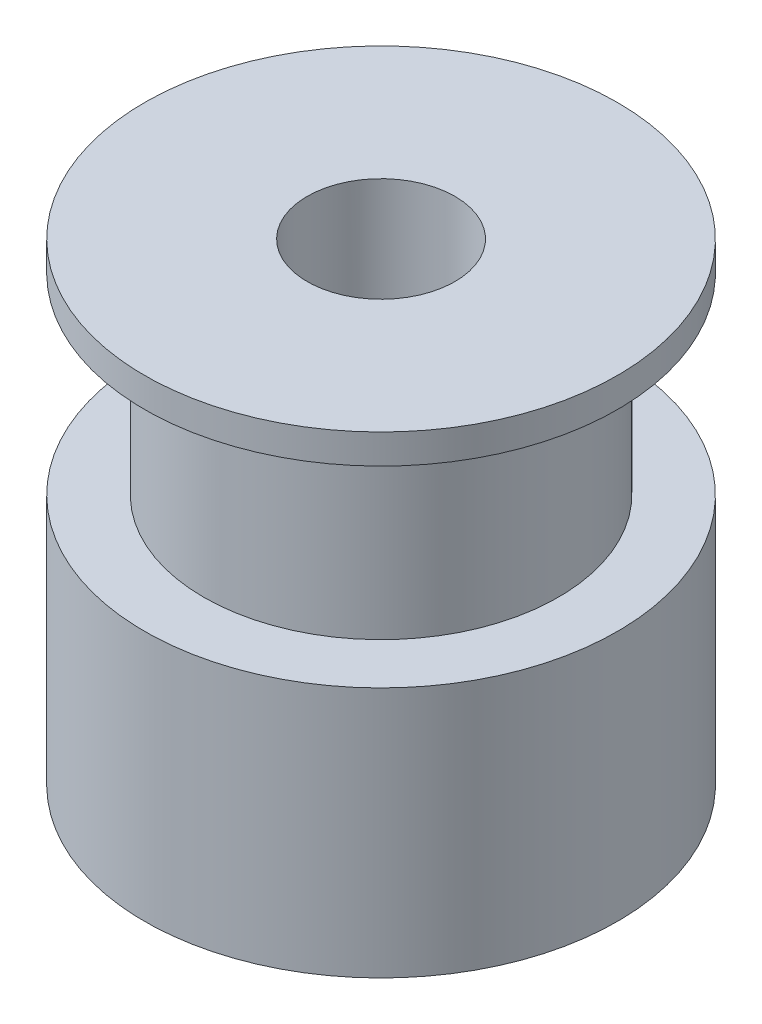
ISO-10303-21;
HEADER;
FILE_DESCRIPTION(('STEP AP214'),'2;1');
FILE_NAME('part.step','',(''),(''),'','','');
FILE_SCHEMA(('AUTOMOTIVE_DESIGN { 1 0 10303 214 1 1 1 1 }'));
ENDSEC;
DATA;
#1=APPLICATION_CONTEXT('core data for automotive mechanical design processes');
#2=APPLICATION_PROTOCOL_DEFINITION('international standard','automotive_design',2000,#1);
#3=PRODUCT_CONTEXT('',#1,'mechanical');
#4=PRODUCT('Part','Part','',(#3));
#5=PRODUCT_RELATED_PRODUCT_CATEGORY('part','',(#4));
#6=PRODUCT_DEFINITION_FORMATION('','',#4);
#7=PRODUCT_DEFINITION_CONTEXT('part definition',#1,'design');
#8=PRODUCT_DEFINITION('design','',#6,#7);
#9=PRODUCT_DEFINITION_SHAPE('','',#8);
#10=(LENGTH_UNIT() NAMED_UNIT(*) SI_UNIT(.MILLI.,.METRE.));
#11=(NAMED_UNIT(*) PLANE_ANGLE_UNIT() SI_UNIT($,.RADIAN.));
#12=(NAMED_UNIT(*) SI_UNIT($,.STERADIAN.) SOLID_ANGLE_UNIT());
#13=UNCERTAINTY_MEASURE_WITH_UNIT(LENGTH_MEASURE(1.E-05),#10,'distance_accuracy_value','');
#14=(GEOMETRIC_REPRESENTATION_CONTEXT(3) GLOBAL_UNCERTAINTY_ASSIGNED_CONTEXT((#13)) GLOBAL_UNIT_ASSIGNED_CONTEXT((#10,
#11,#12)) REPRESENTATION_CONTEXT('',''));
#15=CARTESIAN_POINT('',(0.,0.,0.));
#16=DIRECTION('',(0.,0.,1.));
#17=DIRECTION('',(1.,0.,0.));
#18=AXIS2_PLACEMENT_3D('',#15,#16,#17);
#19=CARTESIAN_POINT('',(0.,0.,0.));
#20=DIRECTION('',(0.,-1.,0.));
#21=DIRECTION('',(0.,0.,-1.));
#22=AXIS2_PLACEMENT_3D('',#19,#20,#21);
#23=CYLINDRICAL_SURFACE('',#22,6.);
#24=CARTESIAN_POINT('',(0.,8.5,0.));
#25=DIRECTION('',(0.,-1.,0.));
#26=DIRECTION('',(0.,0.,-1.));
#27=AXIS2_PLACEMENT_3D('',#24,#25,#26);
#28=CIRCLE('',#27,6.);
#29=CARTESIAN_POINT('',(0.,8.5,-6.));
#30=VERTEX_POINT('',#29);
#31=EDGE_CURVE('E86',#30,#30,#28,.T.);
#32=ORIENTED_EDGE('',*,*,#31,.F.);
#33=EDGE_LOOP('',(#32));
#34=FACE_BOUND('',#33,.T.);
#35=CARTESIAN_POINT('',(0.,15.,0.));
#36=DIRECTION('',(0.,-1.,0.));
#37=DIRECTION('',(0.,0.,-1.));
#38=AXIS2_PLACEMENT_3D('',#35,#36,#37);
#39=CIRCLE('',#38,6.);
#40=CARTESIAN_POINT('',(0.,15.,-6.));
#41=VERTEX_POINT('',#40);
#42=EDGE_CURVE('E54',#41,#41,#39,.T.);
#43=ORIENTED_EDGE('',*,*,#42,.T.);
#44=EDGE_LOOP('',(#43));
#45=FACE_BOUND('',#44,.T.);
#46=ADVANCED_FACE('F39',(#34,#45),#23,.T.);
#47=CARTESIAN_POINT('',(-8.,15.,0.));
#48=DIRECTION('',(0.,1.,0.));
#49=DIRECTION('',(0.,0.,1.));
#50=AXIS2_PLACEMENT_3D('',#47,#48,#49);
#51=PLANE('',#50);
#52=ORIENTED_EDGE('',*,*,#42,.F.);
#53=EDGE_LOOP('',(#52));
#54=FACE_BOUND('',#53,.T.);
#55=CARTESIAN_POINT('',(0.,15.,0.));
#56=DIRECTION('',(0.,-1.,0.));
#57=DIRECTION('',(0.,0.,-1.));
#58=AXIS2_PLACEMENT_3D('',#55,#56,#57);
#59=CIRCLE('',#58,8.);
#60=CARTESIAN_POINT('',(0.,15.,-8.));
#61=VERTEX_POINT('',#60);
#62=EDGE_CURVE('E58',#61,#61,#59,.T.);
#63=ORIENTED_EDGE('',*,*,#62,.T.);
#64=EDGE_LOOP('',(#63));
#65=FACE_BOUND('',#64,.T.);
#66=ADVANCED_FACE('F105',(#54,#65),#51,.F.);
#67=CARTESIAN_POINT('',(0.,0.,0.));
#68=DIRECTION('',(0.,-1.,0.));
#69=DIRECTION('',(0.,0.,-1.));
#70=AXIS2_PLACEMENT_3D('',#67,#68,#69);
#71=CYLINDRICAL_SURFACE('',#70,8.);
#72=ORIENTED_EDGE('',*,*,#62,.F.);
#73=EDGE_LOOP('',(#72));
#74=FACE_BOUND('',#73,.T.);
#75=CARTESIAN_POINT('',(0.,16.,0.));
#76=DIRECTION('',(0.,-1.,0.));
#77=DIRECTION('',(0.,0.,-1.));
#78=AXIS2_PLACEMENT_3D('',#75,#76,#77);
#79=CIRCLE('',#78,8.);
#80=CARTESIAN_POINT('',(0.,16.,-8.));
#81=VERTEX_POINT('',#80);
#82=EDGE_CURVE('E117',#81,#81,#79,.T.);
#83=ORIENTED_EDGE('',*,*,#82,.T.);
#84=EDGE_LOOP('',(#83));
#85=FACE_BOUND('',#84,.T.);
#86=ADVANCED_FACE('F102',(#74,#85),#71,.T.);
#87=CARTESIAN_POINT('',(-2.5,16.,0.));
#88=DIRECTION('',(0.,-1.,0.));
#89=DIRECTION('',(0.,0.,-1.));
#90=AXIS2_PLACEMENT_3D('',#87,#88,#89);
#91=PLANE('',#90);
#92=ORIENTED_EDGE('',*,*,#82,.F.);
#93=EDGE_LOOP('',(#92));
#94=FACE_BOUND('',#93,.T.);
#95=CARTESIAN_POINT('',(0.,16.,0.));
#96=DIRECTION('',(0.,-1.,0.));
#97=DIRECTION('',(0.,0.,-1.));
#98=AXIS2_PLACEMENT_3D('',#95,#96,#97);
#99=CIRCLE('',#98,2.5);
#100=CARTESIAN_POINT('',(0.,16.,-2.5));
#101=VERTEX_POINT('',#100);
#102=EDGE_CURVE('E119',#101,#101,#99,.T.);
#103=ORIENTED_EDGE('',*,*,#102,.T.);
#104=EDGE_LOOP('',(#103));
#105=FACE_BOUND('',#104,.T.);
#106=ADVANCED_FACE('F97',(#94,#105),#91,.F.);
#107=CARTESIAN_POINT('',(0.,0.,0.));
#108=DIRECTION('',(0.,-1.,0.));
#109=DIRECTION('',(0.,0.,-1.));
#110=AXIS2_PLACEMENT_3D('',#107,#108,#109);
#111=CYLINDRICAL_SURFACE('',#110,2.5);
#112=CARTESIAN_POINT('',(0.,5.75,-2.5));
#113=CARTESIAN_POINT('',(0.0767298334620158,5.74999590899012,-2.49999625789732));
#114=CARTESIAN_POINT('',(0.153582320644178,5.74407132907373,-2.4964290461501));
#115=CARTESIAN_POINT('',(0.304975509530679,5.72067568048467,-2.48249903608568));
#116=CARTESIAN_POINT('',(0.379510034596047,5.70317613814577,-2.47211948032719));
#117=CARTESIAN_POINT('',(0.523751827790837,5.65761363883314,-2.44561558054488));
#118=CARTESIAN_POINT('',(0.593481028226566,5.62960304183684,-2.42951973272944));
#119=CARTESIAN_POINT('',(0.727030318214658,5.56413966685897,-2.39295367626407));
#120=CARTESIAN_POINT('',(0.790851869416383,5.52668923303125,-2.37248455380255));
#121=CARTESIAN_POINT('',(0.916299278999315,5.44022517329141,-2.32705360719088));
#122=CARTESIAN_POINT('',(0.977384020081415,5.39054630464861,-2.30186792195985));
#123=CARTESIAN_POINT('',(1.09088270411891,5.28253279617173,-2.25030439279634));
#124=CARTESIAN_POINT('',(1.14328534948112,5.22418706281268,-2.22392505153571));
#125=CARTESIAN_POINT('',(1.24444996762974,5.09207648950327,-2.1691106699591));
#126=CARTESIAN_POINT('',(1.29197766378809,5.01729822901871,-2.14082017703649));
#127=CARTESIAN_POINT('',(1.37361437764896,4.85915342675688,-2.08938301412124));
#128=CARTESIAN_POINT('',(1.4077451733516,4.77580110375243,-2.06622802273938));
#129=CARTESIAN_POINT('',(1.45440601714221,4.62340354934676,-2.0335462966093));
#130=CARTESIAN_POINT('',(1.47016197246826,4.55576400138968,-2.02207883137591));
#131=CARTESIAN_POINT('',(1.49216172340475,4.41819628416964,-2.00590308295503));
#132=CARTESIAN_POINT('',(1.49841734556836,4.34827107124551,-2.00118639643759));
#133=CARTESIAN_POINT('',(1.50105508796009,4.20798850578266,-1.99920922463856));
#134=CARTESIAN_POINT('',(1.49741783408419,4.1376305749068,-2.00196337012718));
#135=CARTESIAN_POINT('',(1.48046060478828,3.99872122457241,-2.01453261443741));
#136=CARTESIAN_POINT('',(1.46713334620103,3.93017120415255,-2.02435302432226));
#137=CARTESIAN_POINT('',(1.43173921881792,3.79746975787189,-2.04953186944258));
#138=CARTESIAN_POINT('',(1.40978748666087,3.73327294607552,-2.06481711652537));
#139=CARTESIAN_POINT('',(1.35795061770837,3.60930500907188,-2.09927051350828));
#140=CARTESIAN_POINT('',(1.32806257259705,3.54953551657607,-2.11844008623465));
#141=CARTESIAN_POINT('',(1.25517983184583,3.4250159028772,-2.16255327268985));
#142=CARTESIAN_POINT('',(1.21080724397723,3.36122190704507,-2.18792043372992));
#143=CARTESIAN_POINT('',(1.11291092784003,3.24132351633298,-2.23930599764381));
#144=CARTESIAN_POINT('',(1.05937845100579,3.18522656602349,-2.26532500262149));
#145=CARTESIAN_POINT('',(0.935811834382966,3.07438701817824,-2.31935504958317));
#146=CARTESIAN_POINT('',(0.864517682704956,3.02092269398401,-2.34713836268532));
#147=CARTESIAN_POINT('',(0.712276050458999,2.92687795280209,-2.39772428433981));
#148=CARTESIAN_POINT('',(0.631333763943563,2.88629064621005,-2.42052955425515));
#149=CARTESIAN_POINT('',(0.467197585268205,2.8220678172041,-2.45730392066151));
#150=CARTESIAN_POINT('',(0.384467624173579,2.79752464428408,-2.47173957439704));
#151=CARTESIAN_POINT('',(0.215047895144639,2.76298880259462,-2.49218842813551));
#152=CARTESIAN_POINT('',(0.128363005661319,2.75297868224642,-2.49821172952738));
#153=CARTESIAN_POINT('',(-0.0337146143773963,2.74849215232169,-2.5009057037461));
#154=CARTESIAN_POINT('',(-0.109042473418718,2.75209114491483,-2.49873521714286));
#155=CARTESIAN_POINT('',(-0.25782940198606,2.77042585307192,-2.48778712087048));
#156=CARTESIAN_POINT('',(-0.331288509376105,2.78516134280581,-2.47900964518037));
#157=CARTESIAN_POINT('',(-0.472574932157613,2.82454343281246,-2.4559479244219));
#158=CARTESIAN_POINT('',(-0.540495750928483,2.84894034907347,-2.44180275662555));
#159=CARTESIAN_POINT('',(-0.671265749087262,2.90667737636527,-2.40913880862844));
#160=CARTESIAN_POINT('',(-0.734113924963908,2.94001925134667,-2.39061916586511));
#161=CARTESIAN_POINT('',(-0.860006262823863,3.0185569792087,-2.3484549623736));
#162=CARTESIAN_POINT('',(-0.922394150456837,3.06462382907839,-2.3244780273988));
#163=CARTESIAN_POINT('',(-1.03902603131014,3.16539139348862,-2.27474265574732));
#164=CARTESIAN_POINT('',(-1.09326040273738,3.22010215485253,-2.2489821658636));
#165=CARTESIAN_POINT('',(-1.19931996735579,3.34491039003715,-2.19445423909891));
#166=CARTESIAN_POINT('',(-1.24991019630915,3.4160838854655,-2.16573241746291));
#167=CARTESIAN_POINT('',(-1.33845238915668,3.5672160245682,-2.1121618206671));
#168=CARTESIAN_POINT('',(-1.37641766769781,3.64716529389278,-2.0873089799769));
#169=CARTESIAN_POINT('',(-1.43142578795776,3.79624302230669,-2.04984909240519));
#170=CARTESIAN_POINT('',(-1.4512162533619,3.86398031235859,-2.03575659328729));
#171=CARTESIAN_POINT('',(-1.48113663905972,4.0025320780801,-2.01409605743544));
#172=CARTESIAN_POINT('',(-1.49127995297631,4.07334214432783,-2.00651897642721));
#173=CARTESIAN_POINT('',(-1.50134130416631,4.21637694759703,-1.99900446616268));
#174=CARTESIAN_POINT('',(-1.50122089107869,4.28860599068704,-1.99909576445937));
#175=CARTESIAN_POINT('',(-1.49066472959328,4.43189443560946,-2.0069771789285));
#176=CARTESIAN_POINT('',(-1.48022337215759,4.50295318008059,-2.0147714813882));
#177=CARTESIAN_POINT('',(-1.45040174148913,4.63848841757219,-2.0363318524298));
#178=CARTESIAN_POINT('',(-1.43147636845351,4.70311709430687,-2.04979211805581));
#179=CARTESIAN_POINT('',(-1.38563242076993,4.82833725447422,-2.08105501960151));
#180=CARTESIAN_POINT('',(-1.35871083588479,4.88892720696055,-2.09885929040482));
#181=CARTESIAN_POINT('',(-1.29289245555732,5.01431985722078,-2.14012990550917));
#182=CARTESIAN_POINT('',(-1.25279167675753,5.07834110385431,-2.16404587582639));
#183=CARTESIAN_POINT('',(-1.16375698389084,5.19938007261729,-2.21320127030768));
#184=CARTESIAN_POINT('',(-1.11481579607798,5.25639196215256,-2.23844177205021));
#185=CARTESIAN_POINT('',(-1.00009777425734,5.37135094913167,-2.29225690291476));
#186=CARTESIAN_POINT('',(-0.932876819313905,5.42793107489619,-2.32070308663658));
#187=CARTESIAN_POINT('',(-0.788462434445589,5.5290978558633,-2.37365428872367));
#188=CARTESIAN_POINT('',(-0.71126544450154,5.57368021198479,-2.39815789310936));
#189=CARTESIAN_POINT('',(-0.551125230801454,5.64778580757373,-2.43985578654394));
#190=CARTESIAN_POINT('',(-0.468430086957214,5.67772806492683,-2.45725077479787));
#191=CARTESIAN_POINT('',(-0.297973306118807,5.72272469521097,-2.48366273001246));
#192=CARTESIAN_POINT('',(-0.210232099648612,5.73783516785699,-2.49271125871485));
#193=CARTESIAN_POINT('',(-0.101558096917536,5.74669745470866,-2.49802001168187));
#194=CARTESIAN_POINT('',(-0.0812762590282776,5.74793441730609,-2.49876114656362));
#195=CARTESIAN_POINT('',(-0.0406658206871124,5.74958624637086,-2.49975164517367));
#196=CARTESIAN_POINT('',(-0.0203372186375695,5.7500010843209,-2.50000099184316));
#197=CARTESIAN_POINT('',(0.,5.75,-2.5));
#198=B_SPLINE_CURVE_WITH_KNOTS('',3,(#112,#113,#114,#115,#116,#117,#118,#119,#120,#121,#122,
#123,#124,#125,#126,#127,#128,#129,#130,#131,#132,#133,#134,#135,#136,#137,#138,#139,#140,#141,
#142,#143,#144,#145,#146,#147,#148,#149,#150,#151,#152,#153,#154,#155,#156,#157,#158,#159,#160,
#161,#162,#163,#164,#165,#166,#167,#168,#169,#170,#171,#172,#173,#174,#175,#176,#177,#178,#179,
#180,#181,#182,#183,#184,#185,#186,#187,#188,#189,#190,#191,#192,#193,#194,#195,#196,#197),
.UNSPECIFIED.,.T.,.F.,(4,2,2,2,2,2,2,2,2,2,2,2,2,2,2,2,2,2,2,2,2,2,2,2,2,2,2,2,2,2,2,2,2,2,2,2,
2,2,2,2,2,2,4),(0.,0.230102237548649,0.460772627520012,0.690308884600011,0.919788197992275,
1.16681590732473,1.41416257934801,1.69183813189807,1.96906040692092,2.17933829855633,
2.38935420916578,2.59978170870726,2.81036753273872,3.01823267593207,3.22617409809868,
3.47046995225163,3.71500044803674,3.99360957884691,4.27206939275324,4.53296790696559,
4.79355286918236,5.01875602722426,5.24395461863455,5.46367785689772,5.68344445659025,
5.92601365818362,6.16886690081836,6.44336762428009,6.71757792616456,6.93257787314692,
7.14727888733318,7.36278425777433,7.57840681155725,7.78364098331142,7.98895251523035,
8.22578610052286,8.46281544370207,8.73854311775518,9.01436946031985,9.28175654462676,
9.54812832184448,9.60911473335177,9.6701032602764),.UNSPECIFIED.);
#199=CARTESIAN_POINT('',(0.,5.75,-2.5));
#200=VERTEX_POINT('',#199);
#201=EDGE_CURVE('E87',#200,#200,#198,.T.);
#202=ORIENTED_EDGE('',*,*,#201,.T.);
#203=EDGE_LOOP('',(#202));
#204=FACE_BOUND('',#203,.T.);
#205=CARTESIAN_POINT('',(-2.,4.25,-1.5));
#206=CARTESIAN_POINT('',(-1.99999416642511,4.17452102471036,-1.50000404108592));
#207=CARTESIAN_POINT('',(-2.00433633903481,4.0990615659202,-1.49426852824013));
#208=CARTESIAN_POINT('',(-2.02092590613883,3.95067609603778,-1.47174965152787));
#209=CARTESIAN_POINT('',(-2.03318155043097,3.8777528126149,-1.45495475788936));
#210=CARTESIAN_POINT('',(-2.0636233903473,3.73691635832272,-1.41143486335795));
#211=CARTESIAN_POINT('',(-2.0817666618312,3.66897116196473,-1.3847815450315));
#212=CARTESIAN_POINT('',(-2.12185904995836,3.53856254663208,-1.32252909283019));
#213=CARTESIAN_POINT('',(-2.14380930122416,3.47610077030486,-1.28692729054693));
#214=CARTESIAN_POINT('',(-2.19228594587542,3.35005098333592,-1.20271292747644));
#215=CARTESIAN_POINT('',(-2.21904371037662,3.28725904287606,-1.15304179435289));
#216=CARTESIAN_POINT('',(-2.27226229431061,3.17023523725824,-1.04426801309985));
#217=CARTESIAN_POINT('',(-2.29872287517103,3.1160098483292,-0.985158296729613));
#218=CARTESIAN_POINT('',(-2.35175567858734,3.0118661902903,-0.851442367411702));
#219=CARTESIAN_POINT('',(-2.37803133577818,2.96304553633025,-0.775851995162548));
#220=CARTESIAN_POINT('',(-2.42443786983179,2.87919027755557,-0.615654228271658));
#221=CARTESIAN_POINT('',(-2.44457437988735,2.84414302587728,-0.531055196626331));
#222=CARTESIAN_POINT('',(-2.4747098780044,2.79240407718735,-0.363771406742667));
#223=CARTESIAN_POINT('',(-2.4854930393917,2.7742796390327,-0.281674698130915));
#224=CARTESIAN_POINT('',(-2.49874939277545,2.75205719713688,-0.114970509382708));
#225=CARTESIAN_POINT('',(-2.50123038813308,2.74794602199994,-0.0303654624001533));
#226=CARTESIAN_POINT('',(-2.49783372711539,2.75361374734246,0.12763728373731));
#227=CARTESIAN_POINT('',(-2.49295437513726,2.76173352616931,0.201123832865635));
#228=CARTESIAN_POINT('',(-2.47707997553857,2.7884797956481,0.345464269151768));
#229=CARTESIAN_POINT('',(-2.46608447529309,2.80710706390715,0.416317961051202));
#230=CARTESIAN_POINT('',(-2.43884907201719,2.85416556270378,0.55405678046908));
#231=CARTESIAN_POINT('',(-2.42257910450824,2.882653061139,0.620916491037617));
#232=CARTESIAN_POINT('',(-2.38609637638748,2.94838461622554,0.748988660115611));
#233=CARTESIAN_POINT('',(-2.36588259201812,2.98563094705901,0.810199646208011));
#234=CARTESIAN_POINT('',(-2.32037925976363,3.07283909280445,0.933074267143199));
#235=CARTESIAN_POINT('',(-2.2947718295215,3.12378831173573,0.993918663198193));
#236=CARTESIAN_POINT('',(-2.24255554245601,3.23440411786017,1.10671465909275));
#237=CARTESIAN_POINT('',(-2.21594536703375,3.2940825034745,1.1586540130834));
#238=CARTESIAN_POINT('',(-2.16111075123946,3.42865340616355,1.25824837767417));
#239=CARTESIAN_POINT('',(-2.13305661385124,3.50450757653946,1.30470933188632));
#240=CARTESIAN_POINT('',(-2.08250879557267,3.66470623163661,1.38397217194232));
#241=CARTESIAN_POINT('',(-2.0600049029882,3.74903471612564,1.41679921962189));
#242=CARTESIAN_POINT('',(-2.02895865196731,3.90239363189535,1.46077497064842));
#243=CARTESIAN_POINT('',(-2.01833888618315,3.97004063229664,1.47527903312665));
#244=CARTESIAN_POINT('',(-2.00392150777558,4.10737361029948,1.49480872755284));
#245=CARTESIAN_POINT('',(-2.00011596115116,4.17705712048456,1.49984538302907));
#246=CARTESIAN_POINT('',(-1.99988914321323,4.31655168243571,1.50014781114183));
#247=CARTESIAN_POINT('',(-2.00347810223984,4.38636277721521,1.49540004697659));
#248=CARTESIAN_POINT('',(-2.01751520788652,4.52398734374856,1.47640290574941));
#249=CARTESIAN_POINT('',(-2.02796877613213,4.59179919224025,1.46214601830139));
#250=CARTESIAN_POINT('',(-2.054317683331,4.72371457947979,1.42488312618657));
#251=CARTESIAN_POINT('',(-2.07020622092812,4.78782263653223,1.40188805257362));
#252=CARTESIAN_POINT('',(-2.10571539417587,4.91147771573018,1.34796261057072));
#253=CARTESIAN_POINT('',(-2.12533743689999,4.971023006366,1.31702924888212));
#254=CARTESIAN_POINT('',(-2.17036819177737,5.09524008251224,1.24167439558512));
#255=CARTESIAN_POINT('',(-2.19618239397369,5.15890083509657,1.19582663060303));
#256=CARTESIAN_POINT('',(-2.2482175480362,5.27828548484946,1.09487395518701));
#257=CARTESIAN_POINT('',(-2.27443886711455,5.33400169216911,1.03976018672402));
#258=CARTESIAN_POINT('',(-2.32835625910913,5.44322400735043,0.913274837212767));
#259=CARTESIAN_POINT('',(-2.3558007587587,5.49550072660584,0.840721108780192));
#260=CARTESIAN_POINT('',(-2.40537639133459,5.58690277683665,0.68610310086802));
#261=CARTESIAN_POINT('',(-2.42751104449411,5.62603682784092,0.604045176134703));
#262=CARTESIAN_POINT('',(-2.46252280092775,5.68686820343136,0.438840232972139));
#263=CARTESIAN_POINT('',(-2.47595588067329,5.7096262277911,0.356205963651258));
#264=CARTESIAN_POINT('',(-2.494407389061,5.74071460284626,0.187383063890857));
#265=CARTESIAN_POINT('',(-2.49943534582737,5.74906129071762,0.101198571781968));
#266=CARTESIAN_POINT('',(-2.50040600461976,5.75067460858593,-0.0598120232009845));
#267=CARTESIAN_POINT('',(-2.49747057186327,5.74580333456303,-0.134620583589707));
#268=CARTESIAN_POINT('',(-2.48512948412095,5.72510617561838,-0.282148755978774));
#269=CARTESIAN_POINT('',(-2.47572375706639,5.7092801686784,-0.354868344701915));
#270=CARTESIAN_POINT('',(-2.45149427526962,5.66778042841621,-0.495145481978797));
#271=CARTESIAN_POINT('',(-2.43675966858906,5.64226840387075,-0.562767032608831));
#272=CARTESIAN_POINT('',(-2.40303337447155,5.58235940544525,-0.692781971999985));
#273=CARTESIAN_POINT('',(-2.38404073252268,5.5479604391404,-0.755174184199833));
#274=CARTESIAN_POINT('',(-2.34093432659381,5.46707480343124,-0.880263645295948));
#275=CARTESIAN_POINT('',(-2.31648844639149,5.41968129098313,-0.94225869043994));
#276=CARTESIAN_POINT('',(-2.26601907350661,5.31624696628228,-1.05789751536307));
#277=CARTESIAN_POINT('',(-2.23999385274509,5.26019657439209,-1.11153190956916));
#278=CARTESIAN_POINT('',(-2.18528165666204,5.1327144378223,-1.2159097535057));
#279=CARTESIAN_POINT('',(-2.15667566270901,5.0602335138345,-1.26542406663368));
#280=CARTESIAN_POINT('',(-2.10376464485145,4.90651514723346,-1.35156817210325));
#281=CARTESIAN_POINT('',(-2.07945738811052,4.82528228601858,-1.38820466322661));
#282=CARTESIAN_POINT('',(-2.0408000304796,4.6629357148628,-1.44437116535132));
#283=CARTESIAN_POINT('',(-2.02577665830138,4.58240476403875,-1.46509526060187));
#284=CARTESIAN_POINT('',(-2.00539032320036,4.41790260529632,-1.49289268240426));
#285=CARTESIAN_POINT('',(-2.00000648744643,4.33393923424129,-1.49999550595837));
#286=CARTESIAN_POINT('',(-2.,4.25,-1.5));
#287=B_SPLINE_CURVE_WITH_KNOTS('',3,(#205,#206,#207,#208,#209,#210,#211,#212,#213,#214,#215,
#216,#217,#218,#219,#220,#221,#222,#223,#224,#225,#226,#227,#228,#229,#230,#231,#232,#233,#234,
#235,#236,#237,#238,#239,#240,#241,#242,#243,#244,#245,#246,#247,#248,#249,#250,#251,#252,#253,
#254,#255,#256,#257,#258,#259,#260,#261,#262,#263,#264,#265,#266,#267,#268,#269,#270,#271,#272,
#273,#274,#275,#276,#277,#278,#279,#280,#281,#282,#283,#284,#285,#286),.UNSPECIFIED.,.T.,.F.,(4,
2,2,2,2,2,2,2,2,2,2,2,2,2,2,2,2,2,2,2,2,2,2,2,2,2,2,2,2,2,2,2,2,2,2,2,2,2,2,2,4),(0.,
0.226085249493393,0.45240657433077,0.677113624991876,0.901887762215933,1.15414462390001,
1.40659128601844,1.68630157736223,1.9657544327122,2.21853330858497,2.47107452602767,
2.69230130543182,2.91354445887944,3.13607155036377,3.35865648368878,3.60782810055849,
3.85733966656908,4.13576671140276,4.41367760154768,4.62276298054684,4.83160475643976,
5.04073566011181,5.25003193304128,5.45906724365495,5.66818149154661,5.91499438482002,
6.16204457978454,6.44121828011588,6.72020638384847,6.97891479383337,7.23732973022726,
7.46129321849399,7.68525920139648,7.90563970188756,8.12606965394584,8.37042963549487,
8.61506198741955,8.89071695766604,9.16622832484805,9.41820120134354,9.66962780912277),.UNSPECIFIED.);
#288=CARTESIAN_POINT('',(-2.,4.25,-1.5));
#289=VERTEX_POINT('',#288);
#290=EDGE_CURVE('E78',#289,#289,#287,.T.);
#291=ORIENTED_EDGE('',*,*,#290,.T.);
#292=EDGE_LOOP('',(#291));
#293=FACE_BOUND('',#292,.T.);
#294=ORIENTED_EDGE('',*,*,#102,.F.);
#295=EDGE_LOOP('',(#294));
#296=FACE_BOUND('',#295,.T.);
#297=CARTESIAN_POINT('',(0.,0.,0.));
#298=DIRECTION('',(0.,-1.,0.));
#299=DIRECTION('',(0.,0.,-1.));
#300=AXIS2_PLACEMENT_3D('',#297,#298,#299);
#301=CIRCLE('',#300,2.5);
#302=CARTESIAN_POINT('',(0.,0.,-2.5));
#303=VERTEX_POINT('',#302);
#304=EDGE_CURVE('E124',#303,#303,#301,.T.);
#305=ORIENTED_EDGE('',*,*,#304,.T.);
#306=EDGE_LOOP('',(#305));
#307=FACE_BOUND('',#306,.T.);
#308=ADVANCED_FACE('F92',(#204,#293,#296,#307),#111,.F.);
#309=CARTESIAN_POINT('',(-8.,0.,0.));
#310=DIRECTION('',(0.,1.,0.));
#311=DIRECTION('',(0.,0.,1.));
#312=AXIS2_PLACEMENT_3D('',#309,#310,#311);
#313=PLANE('',#312);
#314=ORIENTED_EDGE('',*,*,#304,.F.);
#315=EDGE_LOOP('',(#314));
#316=FACE_BOUND('',#315,.T.);
#317=CARTESIAN_POINT('',(0.,0.,0.));
#318=DIRECTION('',(0.,-1.,0.));
#319=DIRECTION('',(0.,0.,-1.));
#320=AXIS2_PLACEMENT_3D('',#317,#318,#319);
#321=CIRCLE('',#320,8.);
#322=CARTESIAN_POINT('',(0.,0.,-8.));
#323=VERTEX_POINT('',#322);
#324=EDGE_CURVE('E127',#323,#323,#321,.T.);
#325=ORIENTED_EDGE('',*,*,#324,.T.);
#326=EDGE_LOOP('',(#325));
#327=FACE_BOUND('',#326,.T.);
#328=ADVANCED_FACE('F96',(#316,#327),#313,.F.);
#329=CARTESIAN_POINT('',(0.,0.,0.));
#330=DIRECTION('',(0.,-1.,0.));
#331=DIRECTION('',(0.,0.,-1.));
#332=AXIS2_PLACEMENT_3D('',#329,#330,#331);
#333=CYLINDRICAL_SURFACE('',#332,8.);
#334=CARTESIAN_POINT('',(0.,5.75,-8.));
#335=CARTESIAN_POINT('',(-0.0834717464654708,5.74999681041172,-7.99999848833852));
#336=CARTESIAN_POINT('',(-0.166984992730098,5.74300892338062,-7.99868009921714));
#337=CARTESIAN_POINT('',(-0.331658129841798,5.71526000488165,-7.9935478589052));
#338=CARTESIAN_POINT('',(-0.412815974152225,5.69448734936026,-7.98973190166897));
#339=CARTESIAN_POINT('',(-0.570372961851801,5.63982729874066,-7.98003138765458));
#340=CARTESIAN_POINT('',(-0.646776330685344,5.60595174754746,-7.97414869946483));
#341=CARTESIAN_POINT('',(-0.792807973094007,5.52608112307718,-7.96095710599783));
#342=CARTESIAN_POINT('',(-0.862436794477323,5.48008703085518,-7.9536483161829));
#343=CARTESIAN_POINT('',(-0.993783715930503,5.37670023199632,-7.93831336430504));
#344=CARTESIAN_POINT('',(-1.05540895503183,5.31919055532986,-7.93028034856351));
#345=CARTESIAN_POINT('',(-1.16819606135369,5.19465669091244,-7.9144531845865));
#346=CARTESIAN_POINT('',(-1.21935717689241,5.12763182023071,-7.90665905354527));
#347=CARTESIAN_POINT('',(-1.31014998665793,4.98531391163603,-7.89212551245005));
#348=CARTESIAN_POINT('',(-1.34968721969605,4.90995962968276,-7.88539493886182));
#349=CARTESIAN_POINT('',(-1.41550524332283,4.75353108482321,-7.87384713211987));
#350=CARTESIAN_POINT('',(-1.44178717713098,4.67245731588878,-7.86902973396962));
#351=CARTESIAN_POINT('',(-1.480050535035,4.50788476908559,-7.8619226957455));
#352=CARTESIAN_POINT('',(-1.49219390192039,4.42442490279654,-7.85960445366405));
#353=CARTESIAN_POINT('',(-1.50233808095346,4.25662261519175,-7.85767197152761));
#354=CARTESIAN_POINT('',(-1.50034016135374,4.1722802736977,-7.8580574889876));
#355=CARTESIAN_POINT('',(-1.48238979602362,4.00628047473395,-7.86146292701753));
#356=CARTESIAN_POINT('',(-1.46662149996045,3.92460228569984,-7.86444808147334));
#357=CARTESIAN_POINT('',(-1.42186799396207,3.76507158021739,-7.87266183284666));
#358=CARTESIAN_POINT('',(-1.39288222239499,3.6872192264907,-7.87789052509516));
#359=CARTESIAN_POINT('',(-1.322336471793,3.53701132099973,-7.89003855292589));
#360=CARTESIAN_POINT('',(-1.28070213532456,3.46469152941919,-7.89696783823366));
#361=CARTESIAN_POINT('',(-1.18609368930416,3.32799527145976,-7.91172971602918));
#362=CARTESIAN_POINT('',(-1.13311842889266,3.2636196122852,-7.91956240015522));
#363=CARTESIAN_POINT('',(-1.01633905685298,3.14357504432754,-7.93540001272164));
#364=CARTESIAN_POINT('',(-0.952377436860682,3.08805934754826,-7.94340571024031));
#365=CARTESIAN_POINT('',(-0.815968037098826,2.98852275932459,-7.95857386108318));
#366=CARTESIAN_POINT('',(-0.743520172255769,2.94450198312958,-7.96573630595245));
#367=CARTESIAN_POINT('',(-0.592034988874668,2.86918224612998,-7.97842539677509));
#368=CARTESIAN_POINT('',(-0.512989564446493,2.8378992208821,-7.98394999136289));
#369=CARTESIAN_POINT('',(-0.350639115398696,2.78909790690784,-7.99272505402719));
#370=CARTESIAN_POINT('',(-0.267334544277787,2.77157815595464,-7.99597576367994));
#371=CARTESIAN_POINT('',(-0.100148652903385,2.75101396898173,-7.99980360641981));
#372=CARTESIAN_POINT('',(-0.016294012634135,2.74775960847027,-8.00041950912279));
#373=CARTESIAN_POINT('',(0.150761248092184,2.75525547954765,-7.99901543598228));
#374=CARTESIAN_POINT('',(0.233961900480386,2.76600502306526,-7.99699558964431));
#375=CARTESIAN_POINT('',(0.396681573218217,2.80102903518337,-7.99057111500406));
#376=CARTESIAN_POINT('',(0.476224261046063,2.82519728253781,-7.98618522374031));
#377=CARTESIAN_POINT('',(0.630128631824633,2.88625770677878,-7.97551842212498));
#378=CARTESIAN_POINT('',(0.704489962595103,2.92315074756578,-7.96923738311334));
#379=CARTESIAN_POINT('',(0.846816671513214,3.00907812815951,-7.95538030357666));
#380=CARTESIAN_POINT('',(0.914703277015122,3.05824073853684,-7.94779086174563));
#381=CARTESIAN_POINT('',(1.04133832326455,3.16713813736236,-7.93219343489712));
#382=CARTESIAN_POINT('',(1.10008590976087,3.22687391300133,-7.92418541084687));
#383=CARTESIAN_POINT('',(1.20757295872048,3.35617231891143,-7.9085247569745));
#384=CARTESIAN_POINT('',(1.25616916218577,3.42585490812539,-7.90087825860257));
#385=CARTESIAN_POINT('',(1.34096675057787,3.57251762452375,-7.88692985578532));
#386=CARTESIAN_POINT('',(1.37716859613924,3.64949748037047,-7.8806279013735));
#387=CARTESIAN_POINT('',(1.43594673512823,3.80820586724254,-7.87013024209574));
#388=CARTESIAN_POINT('',(1.45858868794786,3.88990937955933,-7.86592440436878));
#389=CARTESIAN_POINT('',(1.48980679326235,4.0560472225214,-7.86007203802415));
#390=CARTESIAN_POINT('',(1.49838453270708,4.1404812439704,-7.8584252206579));
#391=CARTESIAN_POINT('',(1.50117762148355,4.30824833144151,-7.85789199803857));
#392=CARTESIAN_POINT('',(1.49561895003499,4.391577580957,-7.85896215974293));
#393=CARTESIAN_POINT('',(1.47079175378803,4.55609142204529,-7.86364600659998));
#394=CARTESIAN_POINT('',(1.45152331089332,4.63727602642744,-7.86725967655747));
#395=CARTESIAN_POINT('',(1.39991887583263,4.79507448479548,-7.8766050802318));
#396=CARTESIAN_POINT('',(1.36760735397252,4.87169659134577,-7.88233284594965));
#397=CARTESIAN_POINT('',(1.29085868912204,5.01846825424084,-7.8952638755184));
#398=CARTESIAN_POINT('',(1.24642068948186,5.08861735284478,-7.90246724360119));
#399=CARTESIAN_POINT('',(1.14589487339535,5.22158368004229,-7.91767266107745));
#400=CARTESIAN_POINT('',(1.08964259864303,5.2842754125671,-7.92568505353043));
#401=CARTESIAN_POINT('',(0.96742792674229,5.39940516246452,-7.94152833918735));
#402=CARTESIAN_POINT('',(0.901463301891616,5.45184082098014,-7.94935919027328));
#403=CARTESIAN_POINT('',(0.760984945071872,5.54541095262706,-7.96403975968049));
#404=CARTESIAN_POINT('',(0.686399590640516,5.58643942849064,-7.97088000990561));
#405=CARTESIAN_POINT('',(0.531290113653832,5.65531763660513,-7.98271619380687));
#406=CARTESIAN_POINT('',(0.450771651705247,5.68317974704691,-7.98771385879037));
#407=CARTESIAN_POINT('',(0.308347202825153,5.71927731441867,-7.99428290707632));
#408=CARTESIAN_POINT('',(0.24727381025187,5.7307786303128,-7.99641470878206));
#409=CARTESIAN_POINT('',(0.124141247115158,5.74614106211645,-7.9992737995401));
#410=CARTESIAN_POINT('',(0.0620821016527093,5.75000237225591,-8.00000112429805));
#411=CARTESIAN_POINT('',(0.,5.75,-8.));
#412=B_SPLINE_CURVE_WITH_KNOTS('',3,(#334,#335,#336,#337,#338,#339,#340,#341,#342,#343,#344,
#345,#346,#347,#348,#349,#350,#351,#352,#353,#354,#355,#356,#357,#358,#359,#360,#361,#362,#363,
#364,#365,#366,#367,#368,#369,#370,#371,#372,#373,#374,#375,#376,#377,#378,#379,#380,#381,#382,
#383,#384,#385,#386,#387,#388,#389,#390,#391,#392,#393,#394,#395,#396,#397,#398,#399,#400,#401,
#402,#403,#404,#405,#406,#407,#408,#409,#410,#411),.UNSPECIFIED.,.T.,.F.,(4,2,2,2,2,2,2,2,2,2,2,
2,2,2,2,2,2,2,2,2,2,2,2,2,2,2,2,2,2,2,2,2,2,2,2,2,2,2,4),(0.,0.250188200964924,
0.500587642535452,0.750761271230907,1.00091465336891,1.2537511801363,1.50660586283617,
1.76146190504357,2.01629596311948,2.26818151445336,2.52004447587256,2.76859000612766,
3.01714609846787,3.26719262629531,3.5172645404986,3.77127768464077,4.02529337544948,
4.27962588321699,4.53393136673745,4.78448174076097,5.03501980464583,5.28360233907828,
5.53220175338032,5.78351778017708,6.03485728413098,6.28953436987299,6.54420198954945,
6.79762627818559,7.05102196946513,7.30039252231748,7.54976158541507,7.79866496207693,
8.04758592655423,8.3002336996638,8.55293951262255,8.80792048916315,9.06266126931173,
9.24874344524409,9.43482089039541),.UNSPECIFIED.);
#413=CARTESIAN_POINT('',(0.,5.75,-8.));
#414=VERTEX_POINT('',#413);
#415=EDGE_CURVE('E10',#414,#414,#412,.T.);
#416=ORIENTED_EDGE('',*,*,#415,.T.);
#417=EDGE_LOOP('',(#416));
#418=FACE_BOUND('',#417,.T.);
#419=CARTESIAN_POINT('',(-8.,2.75,0.));
#420=CARTESIAN_POINT('',(-7.99999848833852,2.75000318958827,-0.0834717464654708));
#421=CARTESIAN_POINT('',(-7.99868009921714,2.75699107661938,-0.166984992730098));
#422=CARTESIAN_POINT('',(-7.9935478589052,2.78473999511835,-0.331658129841797));
#423=CARTESIAN_POINT('',(-7.98973190166897,2.80551265063973,-0.412815974152225));
#424=CARTESIAN_POINT('',(-7.98003138765458,2.86017270125934,-0.570372961851801));
#425=CARTESIAN_POINT('',(-7.97414869946483,2.89404825245254,-0.646776330685344));
#426=CARTESIAN_POINT('',(-7.96095710599783,2.97391887692282,-0.792807973094006));
#427=CARTESIAN_POINT('',(-7.9536483161829,3.01991296914482,-0.862436794477323));
#428=CARTESIAN_POINT('',(-7.93831336430504,3.12329976800367,-0.993783715930502));
#429=CARTESIAN_POINT('',(-7.93028034856351,3.18080944467013,-1.05540895503183));
#430=CARTESIAN_POINT('',(-7.9144531845865,3.30534330908756,-1.16819606135369));
#431=CARTESIAN_POINT('',(-7.90665905354527,3.37236817976928,-1.21935717689241));
#432=CARTESIAN_POINT('',(-7.89212551245005,3.51468608836397,-1.31014998665793));
#433=CARTESIAN_POINT('',(-7.88539493886182,3.59004037031723,-1.34968721969605));
#434=CARTESIAN_POINT('',(-7.87384713211987,3.74646891517679,-1.41550524332283));
#435=CARTESIAN_POINT('',(-7.86902973396962,3.82754268411121,-1.44178717713098));
#436=CARTESIAN_POINT('',(-7.8619226957455,3.99211523091441,-1.480050535035));
#437=CARTESIAN_POINT('',(-7.85960445366405,4.07557509720346,-1.49219390192039));
#438=CARTESIAN_POINT('',(-7.85767197152761,4.24337738480825,-1.50233808095346));
#439=CARTESIAN_POINT('',(-7.8580574889876,4.3277197263023,-1.50034016135374));
#440=CARTESIAN_POINT('',(-7.86146292701753,4.49371952526604,-1.48238979602362));
#441=CARTESIAN_POINT('',(-7.86444808147334,4.57539771430015,-1.46662149996045));
#442=CARTESIAN_POINT('',(-7.87266183284666,4.73492841978261,-1.42186799396207));
#443=CARTESIAN_POINT('',(-7.87789052509516,4.8127807735093,-1.39288222239499));
#444=CARTESIAN_POINT('',(-7.89003855292589,4.96298867900026,-1.322336471793));
#445=CARTESIAN_POINT('',(-7.89696783823366,5.03530847058081,-1.28070213532456));
#446=CARTESIAN_POINT('',(-7.91172971602918,5.17200472854023,-1.18609368930416));
#447=CARTESIAN_POINT('',(-7.91956240015522,5.2363803877148,-1.13311842889266));
#448=CARTESIAN_POINT('',(-7.93540001272164,5.35642495567246,-1.01633905685298));
#449=CARTESIAN_POINT('',(-7.94340571024031,5.41194065245174,-0.952377436860682));
#450=CARTESIAN_POINT('',(-7.95857386108318,5.5114772406754,-0.815968037098826));
#451=CARTESIAN_POINT('',(-7.96573630595245,5.55549801687042,-0.743520172255769));
#452=CARTESIAN_POINT('',(-7.97842539677509,5.63081775387002,-0.592034988874668));
#453=CARTESIAN_POINT('',(-7.98394999136289,5.66210077911789,-0.512989564446494));
#454=CARTESIAN_POINT('',(-7.99272505402719,5.71090209309216,-0.350639115398697));
#455=CARTESIAN_POINT('',(-7.99597576367994,5.72842184404536,-0.267334544277787));
#456=CARTESIAN_POINT('',(-7.99980360641981,5.74898603101827,-0.100148652903385));
#457=CARTESIAN_POINT('',(-8.00041950912279,5.75224039152973,-0.0162940126341352));
#458=CARTESIAN_POINT('',(-7.99901543598228,5.74474452045235,0.150761248092184));
#459=CARTESIAN_POINT('',(-7.99699558964431,5.73399497693474,0.233961900480385));
#460=CARTESIAN_POINT('',(-7.99057111500406,5.69897096481663,0.396681573218217));
#461=CARTESIAN_POINT('',(-7.98618522374031,5.67480271746218,0.476224261046063));
#462=CARTESIAN_POINT('',(-7.97551842212498,5.61374229322121,0.630128631824633));
#463=CARTESIAN_POINT('',(-7.96923738311334,5.57684925243421,0.704489962595103));
#464=CARTESIAN_POINT('',(-7.95538030357666,5.49092187184049,0.846816671513214));
#465=CARTESIAN_POINT('',(-7.94779086174563,5.44175926146316,0.914703277015122));
#466=CARTESIAN_POINT('',(-7.93219343489712,5.33286186263764,1.04133832326455));
#467=CARTESIAN_POINT('',(-7.92418541084687,5.27312608699867,1.10008590976087));
#468=CARTESIAN_POINT('',(-7.9085247569745,5.14382768108857,1.20757295872048));
#469=CARTESIAN_POINT('',(-7.90087825860257,5.07414509187461,1.25616916218577));
#470=CARTESIAN_POINT('',(-7.88692985578532,4.92748237547625,1.34096675057787));
#471=CARTESIAN_POINT('',(-7.8806279013735,4.85050251962952,1.37716859613924));
#472=CARTESIAN_POINT('',(-7.87013024209574,4.69179413275746,1.43594673512823));
#473=CARTESIAN_POINT('',(-7.86592440436878,4.61009062044066,1.45858868794786));
#474=CARTESIAN_POINT('',(-7.86007203802415,4.4439527774786,1.48980679326235));
#475=CARTESIAN_POINT('',(-7.8584252206579,4.3595187560296,1.49838453270708));
#476=CARTESIAN_POINT('',(-7.85789199803857,4.19175166855849,1.50117762148355));
#477=CARTESIAN_POINT('',(-7.85896215974293,4.108422419043,1.49561895003499));
#478=CARTESIAN_POINT('',(-7.86364600659998,3.94390857795471,1.47079175378803));
#479=CARTESIAN_POINT('',(-7.86725967655747,3.86272397357256,1.45152331089332));
#480=CARTESIAN_POINT('',(-7.8766050802318,3.70492551520452,1.39991887583263));
#481=CARTESIAN_POINT('',(-7.88233284594965,3.62830340865423,1.36760735397252));
#482=CARTESIAN_POINT('',(-7.8952638755184,3.48153174575915,1.29085868912204));
#483=CARTESIAN_POINT('',(-7.90246724360119,3.41138264715522,1.24642068948186));
#484=CARTESIAN_POINT('',(-7.91767266107745,3.2784163199577,1.14589487339535));
#485=CARTESIAN_POINT('',(-7.92568505353043,3.2157245874329,1.08964259864303));
#486=CARTESIAN_POINT('',(-7.94152833918735,3.10059483753548,0.96742792674229));
#487=CARTESIAN_POINT('',(-7.94935919027328,3.04815917901986,0.901463301891615));
#488=CARTESIAN_POINT('',(-7.96403975968049,2.95458904737294,0.760984945071872));
#489=CARTESIAN_POINT('',(-7.97088000990561,2.91356057150936,0.686399590640516));
#490=CARTESIAN_POINT('',(-7.98271619380687,2.84468236339486,0.531290113653834));
#491=CARTESIAN_POINT('',(-7.98771385879037,2.81682025295309,0.450771651705248));
#492=CARTESIAN_POINT('',(-7.99428290707632,2.78072268558132,0.308347202825153));
#493=CARTESIAN_POINT('',(-7.99641470878206,2.7692213696872,0.24727381025187));
#494=CARTESIAN_POINT('',(-7.9992737995401,2.75385893788355,0.124141247115158));
#495=CARTESIAN_POINT('',(-8.00000112429805,2.74999762774409,0.0620821016527094));
#496=CARTESIAN_POINT('',(-8.,2.75,0.));
#497=B_SPLINE_CURVE_WITH_KNOTS('',3,(#419,#420,#421,#422,#423,#424,#425,#426,#427,#428,#429,
#430,#431,#432,#433,#434,#435,#436,#437,#438,#439,#440,#441,#442,#443,#444,#445,#446,#447,#448,
#449,#450,#451,#452,#453,#454,#455,#456,#457,#458,#459,#460,#461,#462,#463,#464,#465,#466,#467,
#468,#469,#470,#471,#472,#473,#474,#475,#476,#477,#478,#479,#480,#481,#482,#483,#484,#485,#486,
#487,#488,#489,#490,#491,#492,#493,#494,#495,#496),.UNSPECIFIED.,.T.,.F.,(4,2,2,2,2,2,2,2,2,2,2,
2,2,2,2,2,2,2,2,2,2,2,2,2,2,2,2,2,2,2,2,2,2,2,2,2,2,2,4),(0.,0.250188200964924,
0.500587642535452,0.750761271230907,1.00091465336891,1.2537511801363,1.50660586283617,
1.76146190504357,2.01629596311948,2.26818151445336,2.52004447587256,2.76859000612766,
3.01714609846787,3.26719262629531,3.5172645404986,3.77127768464077,4.02529337544948,
4.27962588321699,4.53393136673745,4.78448174076097,5.03501980464583,5.28360233907828,
5.53220175338032,5.78351778017708,6.03485728413098,6.28953436987299,6.54420198954945,
6.79762627818559,7.05102196946513,7.30039252231748,7.54976158541507,7.79866496207693,
8.04758592655423,8.3002336996638,8.55293951262255,8.80792048916314,9.06266126931173,
9.24874344524409,9.43482089039541),.UNSPECIFIED.);
#498=CARTESIAN_POINT('',(-8.,2.75,0.));
#499=VERTEX_POINT('',#498);
#500=EDGE_CURVE('E50',#499,#499,#497,.T.);
#501=ORIENTED_EDGE('',*,*,#500,.T.);
#502=EDGE_LOOP('',(#501));
#503=FACE_BOUND('',#502,.T.);
#504=ORIENTED_EDGE('',*,*,#324,.F.);
#505=EDGE_LOOP('',(#504));
#506=FACE_BOUND('',#505,.T.);
#507=CARTESIAN_POINT('',(0.,8.5,0.));
#508=DIRECTION('',(0.,-1.,0.));
#509=DIRECTION('',(0.,0.,-1.));
#510=AXIS2_PLACEMENT_3D('',#507,#508,#509);
#511=CIRCLE('',#510,8.);
#512=CARTESIAN_POINT('',(0.,8.5,-8.));
#513=VERTEX_POINT('',#512);
#514=EDGE_CURVE('E129',#513,#513,#511,.T.);
#515=ORIENTED_EDGE('',*,*,#514,.T.);
#516=EDGE_LOOP('',(#515));
#517=FACE_BOUND('',#516,.T.);
#518=ADVANCED_FACE('F65',(#418,#503,#506,#517),#333,.T.);
#519=CARTESIAN_POINT('',(-6.,8.5,0.));
#520=DIRECTION('',(0.,-1.,0.));
#521=DIRECTION('',(0.,0.,-1.));
#522=AXIS2_PLACEMENT_3D('',#519,#520,#521);
#523=PLANE('',#522);
#524=ORIENTED_EDGE('',*,*,#514,.F.);
#525=EDGE_LOOP('',(#524));
#526=FACE_BOUND('',#525,.T.);
#527=ORIENTED_EDGE('',*,*,#31,.T.);
#528=EDGE_LOOP('',(#527));
#529=FACE_BOUND('',#528,.T.);
#530=ADVANCED_FACE('F73',(#526,#529),#523,.F.);
#531=CARTESIAN_POINT('',(-8.,4.25,0.));
#532=DIRECTION('',(1.,0.,0.));
#533=DIRECTION('',(0.,0.,-1.));
#534=AXIS2_PLACEMENT_3D('',#531,#532,#533);
#535=CYLINDRICAL_SURFACE('',#534,1.5);
#536=ORIENTED_EDGE('',*,*,#500,.F.);
#537=EDGE_LOOP('',(#536));
#538=FACE_BOUND('',#537,.T.);
#539=ORIENTED_EDGE('',*,*,#290,.F.);
#540=EDGE_LOOP('',(#539));
#541=FACE_BOUND('',#540,.T.);
#542=ADVANCED_FACE('F69',(#538,#541),#535,.F.);
#543=CARTESIAN_POINT('',(0.,4.25,-8.));
#544=DIRECTION('',(0.,0.,1.));
#545=DIRECTION('',(1.,0.,0.));
#546=AXIS2_PLACEMENT_3D('',#543,#544,#545);
#547=CYLINDRICAL_SURFACE('',#546,1.5);
#548=ORIENTED_EDGE('',*,*,#415,.F.);
#549=EDGE_LOOP('',(#548));
#550=FACE_BOUND('',#549,.T.);
#551=ORIENTED_EDGE('',*,*,#201,.F.);
#552=EDGE_LOOP('',(#551));
#553=FACE_BOUND('',#552,.T.);
#554=ADVANCED_FACE('F72',(#550,#553),#547,.F.);
#555=CLOSED_SHELL('',(#46,#66,#86,#106,#308,#328,#518,#530,#542,#554));
#556=MANIFOLD_SOLID_BREP('B2',#555);
#557=ADVANCED_BREP_SHAPE_REPRESENTATION('',(#18,#556),#14);
#558=SHAPE_DEFINITION_REPRESENTATION(#9,#557);
ENDSEC;
END-ISO-10303-21;
